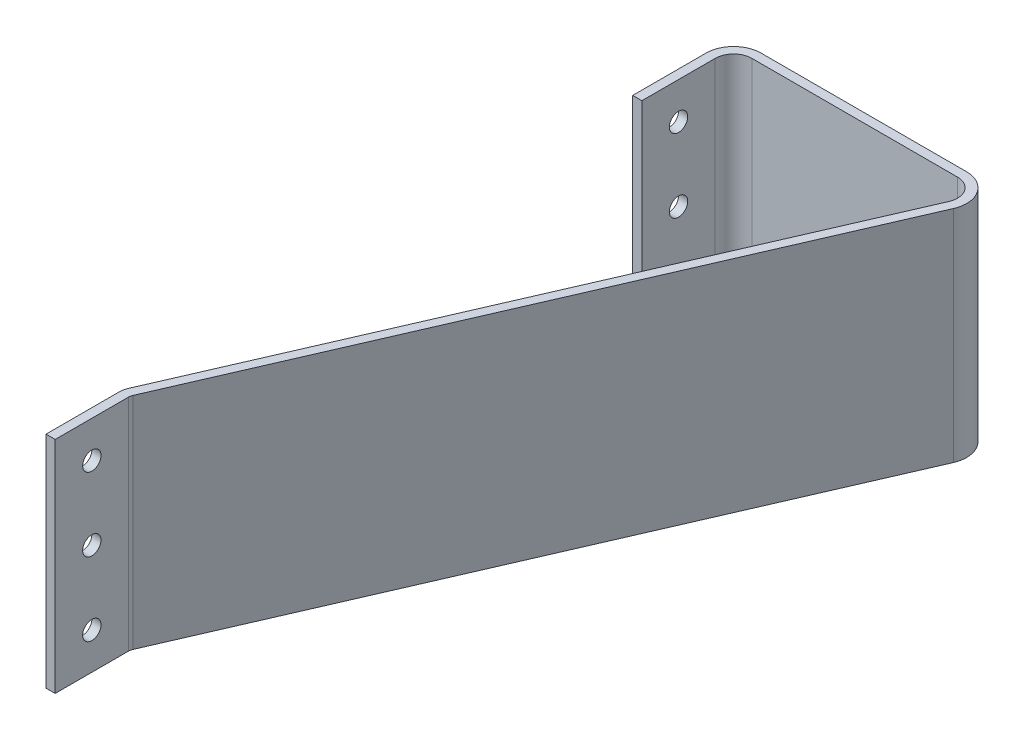
ISO-10303-21;
HEADER;
FILE_DESCRIPTION(('STEP AP214'),'2;1');
FILE_NAME('part.step','',(''),(''),'','','');
FILE_SCHEMA(('AUTOMOTIVE_DESIGN { 1 0 10303 214 1 1 1 1 }'));
ENDSEC;
DATA;
#1=APPLICATION_CONTEXT('core data for automotive mechanical design processes');
#2=APPLICATION_PROTOCOL_DEFINITION('international standard','automotive_design',2000,#1);
#3=PRODUCT_CONTEXT('',#1,'mechanical');
#4=PRODUCT('Part','Part','',(#3));
#5=PRODUCT_RELATED_PRODUCT_CATEGORY('part','',(#4));
#6=PRODUCT_DEFINITION_FORMATION('','',#4);
#7=PRODUCT_DEFINITION_CONTEXT('part definition',#1,'design');
#8=PRODUCT_DEFINITION('design','',#6,#7);
#9=PRODUCT_DEFINITION_SHAPE('','',#8);
#10=(LENGTH_UNIT() NAMED_UNIT(*) SI_UNIT(.MILLI.,.METRE.));
#11=(NAMED_UNIT(*) PLANE_ANGLE_UNIT() SI_UNIT($,.RADIAN.));
#12=(NAMED_UNIT(*) SI_UNIT($,.STERADIAN.) SOLID_ANGLE_UNIT());
#13=UNCERTAINTY_MEASURE_WITH_UNIT(LENGTH_MEASURE(1.E-05),#10,'distance_accuracy_value','');
#14=(GEOMETRIC_REPRESENTATION_CONTEXT(3) GLOBAL_UNCERTAINTY_ASSIGNED_CONTEXT((#13)) GLOBAL_UNIT_ASSIGNED_CONTEXT((#10,
#11,#12)) REPRESENTATION_CONTEXT('',''));
#15=CARTESIAN_POINT('',(0.,0.,0.));
#16=DIRECTION('',(0.,0.,1.));
#17=DIRECTION('',(1.,0.,0.));
#18=AXIS2_PLACEMENT_3D('',#15,#16,#17);
#19=CARTESIAN_POINT('',(-279.4,76.2,0.));
#20=DIRECTION('',(0.,0.,-1.));
#21=DIRECTION('',(-1.,0.,0.));
#22=AXIS2_PLACEMENT_3D('',#19,#20,#21);
#23=PLANE('',#22);
#24=DIRECTION('',(1.,0.,0.));
#25=VECTOR('',#24,1.);
#26=CARTESIAN_POINT('',(-279.4,0.,0.));
#27=LINE('',#26,#25);
#28=CARTESIAN_POINT('',(-279.4,0.,0.));
#29=VERTEX_POINT('',#28);
#30=CARTESIAN_POINT('',(-276.225,0.,0.));
#31=VERTEX_POINT('',#30);
#32=EDGE_CURVE('E192',#29,#31,#27,.T.);
#33=ORIENTED_EDGE('',*,*,#32,.T.);
#34=DIRECTION('',(0.,-1.,0.));
#35=VECTOR('',#34,1.);
#36=CARTESIAN_POINT('',(-276.225,76.2,0.));
#37=LINE('',#36,#35);
#38=CARTESIAN_POINT('',(-276.225,76.2,0.));
#39=VERTEX_POINT('',#38);
#40=EDGE_CURVE('E11',#39,#31,#37,.T.);
#41=ORIENTED_EDGE('',*,*,#40,.F.);
#42=DIRECTION('',(1.,0.,0.));
#43=VECTOR('',#42,1.);
#44=CARTESIAN_POINT('',(-279.4,76.2,0.));
#45=LINE('',#44,#43);
#46=CARTESIAN_POINT('',(-279.4,76.2,0.));
#47=VERTEX_POINT('',#46);
#48=EDGE_CURVE('E239',#47,#39,#45,.T.);
#49=ORIENTED_EDGE('',*,*,#48,.F.);
#50=DIRECTION('',(0.,-1.,0.));
#51=VECTOR('',#50,1.);
#52=CARTESIAN_POINT('',(-279.4,76.2,0.));
#53=LINE('',#52,#51);
#54=EDGE_CURVE('E188',#47,#29,#53,.T.);
#55=ORIENTED_EDGE('',*,*,#54,.T.);
#56=EDGE_LOOP('',(#33,#41,#49,#55));
#57=FACE_BOUND('',#56,.T.);
#58=ADVANCED_FACE('F43',(#57),#23,.F.);
#59=CARTESIAN_POINT('',(-276.225,76.2,0.));
#60=DIRECTION('',(-1.,0.,0.));
#61=DIRECTION('',(0.,0.,1.));
#62=AXIS2_PLACEMENT_3D('',#59,#60,#61);
#63=PLANE('',#62);
#64=CARTESIAN_POINT('',(-276.225,63.5,-12.7));
#65=DIRECTION('',(-1.,0.,0.));
#66=DIRECTION('',(0.,0.,1.));
#67=AXIS2_PLACEMENT_3D('',#64,#65,#66);
#68=CIRCLE('',#67,3.175);
#69=CARTESIAN_POINT('',(-276.225,63.5,-9.525));
#70=VERTEX_POINT('',#69);
#71=EDGE_CURVE('E197',#70,#70,#68,.T.);
#72=ORIENTED_EDGE('',*,*,#71,.T.);
#73=EDGE_LOOP('',(#72));
#74=FACE_BOUND('',#73,.T.);
#75=CARTESIAN_POINT('',(-276.225,38.1,-12.7));
#76=DIRECTION('',(-1.,0.,0.));
#77=DIRECTION('',(0.,0.,1.));
#78=AXIS2_PLACEMENT_3D('',#75,#76,#77);
#79=CIRCLE('',#78,3.175);
#80=CARTESIAN_POINT('',(-276.225,38.1,-9.525));
#81=VERTEX_POINT('',#80);
#82=EDGE_CURVE('E661',#81,#81,#79,.T.);
#83=ORIENTED_EDGE('',*,*,#82,.T.);
#84=EDGE_LOOP('',(#83));
#85=FACE_BOUND('',#84,.T.);
#86=CARTESIAN_POINT('',(-276.225,12.7,-12.7));
#87=DIRECTION('',(-1.,0.,0.));
#88=DIRECTION('',(0.,0.,1.));
#89=AXIS2_PLACEMENT_3D('',#86,#87,#88);
#90=CIRCLE('',#89,3.175);
#91=CARTESIAN_POINT('',(-276.225,12.7,-9.52500000000001));
#92=VERTEX_POINT('',#91);
#93=EDGE_CURVE('E650',#92,#92,#90,.T.);
#94=ORIENTED_EDGE('',*,*,#93,.T.);
#95=EDGE_LOOP('',(#94));
#96=FACE_BOUND('',#95,.T.);
#97=DIRECTION('',(0.,0.,-1.));
#98=VECTOR('',#97,1.);
#99=CARTESIAN_POINT('',(-276.225,0.,0.));
#100=LINE('',#99,#98);
#101=CARTESIAN_POINT('',(-276.225,0.,-25.4));
#102=VERTEX_POINT('',#101);
#103=EDGE_CURVE('E196',#31,#102,#100,.T.);
#104=ORIENTED_EDGE('',*,*,#103,.T.);
#105=DIRECTION('',(0.,-1.,0.));
#106=VECTOR('',#105,1.);
#107=CARTESIAN_POINT('',(-276.225,76.2,-25.4));
#108=LINE('',#107,#106);
#109=CARTESIAN_POINT('',(-276.225,76.2,-25.4));
#110=VERTEX_POINT('',#109);
#111=EDGE_CURVE('E52',#110,#102,#108,.T.);
#112=ORIENTED_EDGE('',*,*,#111,.F.);
#113=DIRECTION('',(0.,0.,-1.));
#114=VECTOR('',#113,1.);
#115=CARTESIAN_POINT('',(-276.225,76.2,0.));
#116=LINE('',#115,#114);
#117=EDGE_CURVE('E127',#39,#110,#116,.T.);
#118=ORIENTED_EDGE('',*,*,#117,.F.);
#119=ORIENTED_EDGE('',*,*,#40,.T.);
#120=EDGE_LOOP('',(#104,#112,#118,#119));
#121=FACE_BOUND('',#120,.T.);
#122=ADVANCED_FACE('F364',(#74,#85,#96,#121),#63,.F.);
#123=CARTESIAN_POINT('',(-273.05,76.2,-25.4));
#124=DIRECTION('',(0.,-1.,0.));
#125=DIRECTION('',(0.,0.,-1.));
#126=AXIS2_PLACEMENT_3D('',#123,#124,#125);
#127=CYLINDRICAL_SURFACE('',#126,3.17499999999998);
#128=CARTESIAN_POINT('',(-273.05,0.,-25.4));
#129=DIRECTION('',(0.,-1.,0.));
#130=DIRECTION('',(0.,0.,-1.));
#131=AXIS2_PLACEMENT_3D('',#128,#129,#130);
#132=CIRCLE('',#131,3.17499999999998);
#133=CARTESIAN_POINT('',(-275.962336725383,0.,-26.6644840046377));
#134=VERTEX_POINT('',#133);
#135=EDGE_CURVE('E200',#102,#134,#132,.T.);
#136=ORIENTED_EDGE('',*,*,#135,.T.);
#137=DIRECTION('',(0.,-1.,0.));
#138=VECTOR('',#137,1.);
#139=CARTESIAN_POINT('',(-275.962336725383,76.2,-26.6644840046377));
#140=LINE('',#139,#138);
#141=CARTESIAN_POINT('',(-275.962336725383,76.2,-26.6644840046377));
#142=VERTEX_POINT('',#141);
#143=EDGE_CURVE('E282',#142,#134,#140,.T.);
#144=ORIENTED_EDGE('',*,*,#143,.F.);
#145=CARTESIAN_POINT('',(-273.05,76.2,-25.4));
#146=DIRECTION('',(0.,-1.,0.));
#147=DIRECTION('',(0.,0.,-1.));
#148=AXIS2_PLACEMENT_3D('',#145,#146,#147);
#149=CIRCLE('',#148,3.17499999999998);
#150=EDGE_CURVE('E292',#110,#142,#149,.T.);
#151=ORIENTED_EDGE('',*,*,#150,.F.);
#152=ORIENTED_EDGE('',*,*,#111,.T.);
#153=EDGE_LOOP('',(#136,#144,#151,#152));
#154=FACE_BOUND('',#153,.T.);
#155=ADVANCED_FACE('F290',(#154),#127,.F.);
#156=CARTESIAN_POINT('',(-275.962336725383,76.2,-26.6644840046377));
#157=DIRECTION('',(-0.91727140956949,0.,-0.398262678626055));
#158=DIRECTION('',(-0.398262678626055,0.,0.91727140956949));
#159=AXIS2_PLACEMENT_3D('',#156,#157,#158);
#160=PLANE('',#159);
#161=DIRECTION('',(0.398262678626055,0.,-0.91727140956949));
#162=VECTOR('',#161,1.);
#163=CARTESIAN_POINT('',(-275.962336725383,0.,-26.6644840046377));
#164=LINE('',#163,#162);
#165=CARTESIAN_POINT('',(-189.932631311602,0.,-224.806547986087));
#166=VERTEX_POINT('',#165);
#167=EDGE_CURVE('E203',#134,#166,#164,.T.);
#168=ORIENTED_EDGE('',*,*,#167,.T.);
#169=DIRECTION('',(0.,-1.,0.));
#170=VECTOR('',#169,1.);
#171=CARTESIAN_POINT('',(-189.932631311602,76.2,-224.806547986087));
#172=LINE('',#171,#170);
#173=CARTESIAN_POINT('',(-189.932631311602,76.2,-224.806547986087));
#174=VERTEX_POINT('',#173);
#175=EDGE_CURVE('E278',#174,#166,#172,.T.);
#176=ORIENTED_EDGE('',*,*,#175,.F.);
#177=DIRECTION('',(0.398262678626055,0.,-0.91727140956949));
#178=VECTOR('',#177,1.);
#179=CARTESIAN_POINT('',(-275.962336725383,76.2,-26.6644840046377));
#180=LINE('',#179,#178);
#181=EDGE_CURVE('E311',#142,#174,#180,.T.);
#182=ORIENTED_EDGE('',*,*,#181,.F.);
#183=ORIENTED_EDGE('',*,*,#143,.T.);
#184=EDGE_LOOP('',(#168,#176,#182,#183));
#185=FACE_BOUND('',#184,.T.);
#186=ADVANCED_FACE('F301',(#185),#160,.F.);
#187=CARTESIAN_POINT('',(-198.669641487751,76.2,-228.6));
#188=DIRECTION('',(0.,-1.,0.));
#189=DIRECTION('',(0.,0.,-1.));
#190=AXIS2_PLACEMENT_3D('',#187,#188,#189);
#191=CYLINDRICAL_SURFACE('',#190,9.52499999999998);
#192=CARTESIAN_POINT('',(-198.669641487751,0.,-228.6));
#193=DIRECTION('',(0.,1.,0.));
#194=DIRECTION('',(0.,0.,1.));
#195=AXIS2_PLACEMENT_3D('',#192,#193,#194);
#196=CIRCLE('',#195,9.52499999999998);
#197=CARTESIAN_POINT('',(-198.669641487751,0.,-238.125));
#198=VERTEX_POINT('',#197);
#199=EDGE_CURVE('E206',#166,#198,#196,.T.);
#200=ORIENTED_EDGE('',*,*,#199,.T.);
#201=DIRECTION('',(0.,-1.,0.));
#202=VECTOR('',#201,1.);
#203=CARTESIAN_POINT('',(-198.669641487751,76.2,-238.125));
#204=LINE('',#203,#202);
#205=CARTESIAN_POINT('',(-198.669641487751,76.2,-238.125));
#206=VERTEX_POINT('',#205);
#207=EDGE_CURVE('E274',#206,#198,#204,.T.);
#208=ORIENTED_EDGE('',*,*,#207,.F.);
#209=CARTESIAN_POINT('',(-198.669641487751,76.2,-228.6));
#210=DIRECTION('',(0.,1.,0.));
#211=DIRECTION('',(0.,0.,1.));
#212=AXIS2_PLACEMENT_3D('',#209,#210,#211);
#213=CIRCLE('',#212,9.52499999999998);
#214=EDGE_CURVE('E307',#174,#206,#213,.T.);
#215=ORIENTED_EDGE('',*,*,#214,.F.);
#216=ORIENTED_EDGE('',*,*,#175,.T.);
#217=EDGE_LOOP('',(#200,#208,#215,#216));
#218=FACE_BOUND('',#217,.T.);
#219=ADVANCED_FACE('F305',(#218),#191,.T.);
#220=CARTESIAN_POINT('',(-269.875,76.2,-238.125));
#221=DIRECTION('',(0.,0.,1.));
#222=DIRECTION('',(1.,0.,0.));
#223=AXIS2_PLACEMENT_3D('',#220,#221,#222);
#224=PLANE('',#223);
#225=DIRECTION('',(-1.,0.,0.));
#226=VECTOR('',#225,1.);
#227=CARTESIAN_POINT('',(-269.875,0.,-238.125));
#228=LINE('',#227,#226);
#229=CARTESIAN_POINT('',(-269.875,0.,-238.125));
#230=VERTEX_POINT('',#229);
#231=EDGE_CURVE('E209',#198,#230,#228,.T.);
#232=ORIENTED_EDGE('',*,*,#231,.T.);
#233=DIRECTION('',(0.,-1.,0.));
#234=VECTOR('',#233,1.);
#235=CARTESIAN_POINT('',(-269.875,76.2,-238.125));
#236=LINE('',#235,#234);
#237=CARTESIAN_POINT('',(-269.875,76.2,-238.125));
#238=VERTEX_POINT('',#237);
#239=EDGE_CURVE('E270',#238,#230,#236,.T.);
#240=ORIENTED_EDGE('',*,*,#239,.F.);
#241=DIRECTION('',(-1.,0.,0.));
#242=VECTOR('',#241,1.);
#243=CARTESIAN_POINT('',(-269.875,76.2,-238.125));
#244=LINE('',#243,#242);
#245=EDGE_CURVE('E310',#206,#238,#244,.T.);
#246=ORIENTED_EDGE('',*,*,#245,.F.);
#247=ORIENTED_EDGE('',*,*,#207,.T.);
#248=EDGE_LOOP('',(#232,#240,#246,#247));
#249=FACE_BOUND('',#248,.T.);
#250=ADVANCED_FACE('F380',(#249),#224,.F.);
#251=CARTESIAN_POINT('',(-269.875,76.2,-228.6));
#252=DIRECTION('',(0.,-1.,0.));
#253=DIRECTION('',(0.,0.,-1.));
#254=AXIS2_PLACEMENT_3D('',#251,#252,#253);
#255=CYLINDRICAL_SURFACE('',#254,9.52500000000001);
#256=CARTESIAN_POINT('',(-269.875,0.,-228.6));
#257=DIRECTION('',(0.,1.,0.));
#258=DIRECTION('',(0.,0.,-1.));
#259=AXIS2_PLACEMENT_3D('',#256,#257,#258);
#260=CIRCLE('',#259,9.52500000000001);
#261=CARTESIAN_POINT('',(-279.4,0.,-228.6));
#262=VERTEX_POINT('',#261);
#263=EDGE_CURVE('E212',#230,#262,#260,.T.);
#264=ORIENTED_EDGE('',*,*,#263,.T.);
#265=DIRECTION('',(0.,-1.,0.));
#266=VECTOR('',#265,1.);
#267=CARTESIAN_POINT('',(-279.4,76.2,-228.6));
#268=LINE('',#267,#266);
#269=CARTESIAN_POINT('',(-279.4,76.2,-228.6));
#270=VERTEX_POINT('',#269);
#271=EDGE_CURVE('E266',#270,#262,#268,.T.);
#272=ORIENTED_EDGE('',*,*,#271,.F.);
#273=CARTESIAN_POINT('',(-269.875,76.2,-228.6));
#274=DIRECTION('',(0.,1.,0.));
#275=DIRECTION('',(0.,0.,-1.));
#276=AXIS2_PLACEMENT_3D('',#273,#274,#275);
#277=CIRCLE('',#276,9.52500000000001);
#278=EDGE_CURVE('E315',#238,#270,#277,.T.);
#279=ORIENTED_EDGE('',*,*,#278,.F.);
#280=ORIENTED_EDGE('',*,*,#239,.T.);
#281=EDGE_LOOP('',(#264,#272,#279,#280));
#282=FACE_BOUND('',#281,.T.);
#283=ADVANCED_FACE('F383',(#282),#255,.T.);
#284=CARTESIAN_POINT('',(-279.4,76.2,-228.6));
#285=DIRECTION('',(1.,0.,0.));
#286=DIRECTION('',(0.,0.,-1.));
#287=AXIS2_PLACEMENT_3D('',#284,#285,#286);
#288=PLANE('',#287);
#289=CARTESIAN_POINT('',(-279.4,12.7,-215.9));
#290=DIRECTION('',(-1.,0.,0.));
#291=DIRECTION('',(0.,0.,1.));
#292=AXIS2_PLACEMENT_3D('',#289,#290,#291);
#293=CIRCLE('',#292,3.17499999999997);
#294=CARTESIAN_POINT('',(-279.4,12.7,-212.725));
#295=VERTEX_POINT('',#294);
#296=EDGE_CURVE('E626',#295,#295,#293,.T.);
#297=ORIENTED_EDGE('',*,*,#296,.F.);
#298=EDGE_LOOP('',(#297));
#299=FACE_BOUND('',#298,.T.);
#300=CARTESIAN_POINT('',(-279.4,63.5,-215.9));
#301=DIRECTION('',(-1.,0.,0.));
#302=DIRECTION('',(0.,0.,1.));
#303=AXIS2_PLACEMENT_3D('',#300,#301,#302);
#304=CIRCLE('',#303,3.17499999999997);
#305=CARTESIAN_POINT('',(-279.4,63.5,-212.725));
#306=VERTEX_POINT('',#305);
#307=EDGE_CURVE('E633',#306,#306,#304,.T.);
#308=ORIENTED_EDGE('',*,*,#307,.F.);
#309=EDGE_LOOP('',(#308));
#310=FACE_BOUND('',#309,.T.);
#311=CARTESIAN_POINT('',(-279.4,38.1,-215.9));
#312=DIRECTION('',(-1.,0.,0.));
#313=DIRECTION('',(0.,0.,1.));
#314=AXIS2_PLACEMENT_3D('',#311,#312,#313);
#315=CIRCLE('',#314,3.17499999999997);
#316=CARTESIAN_POINT('',(-279.4,38.1,-212.725));
#317=VERTEX_POINT('',#316);
#318=EDGE_CURVE('E638',#317,#317,#315,.T.);
#319=ORIENTED_EDGE('',*,*,#318,.F.);
#320=EDGE_LOOP('',(#319));
#321=FACE_BOUND('',#320,.T.);
#322=DIRECTION('',(0.,0.,1.));
#323=VECTOR('',#322,1.);
#324=CARTESIAN_POINT('',(-279.4,0.,-228.6));
#325=LINE('',#324,#323);
#326=CARTESIAN_POINT('',(-279.4,0.,-203.2));
#327=VERTEX_POINT('',#326);
#328=EDGE_CURVE('E215',#262,#327,#325,.T.);
#329=ORIENTED_EDGE('',*,*,#328,.T.);
#330=DIRECTION('',(0.,-1.,0.));
#331=VECTOR('',#330,1.);
#332=CARTESIAN_POINT('',(-279.4,76.2,-203.2));
#333=LINE('',#332,#331);
#334=CARTESIAN_POINT('',(-279.4,76.2,-203.2));
#335=VERTEX_POINT('',#334);
#336=EDGE_CURVE('E262',#335,#327,#333,.T.);
#337=ORIENTED_EDGE('',*,*,#336,.F.);
#338=DIRECTION('',(0.,0.,1.));
#339=VECTOR('',#338,1.);
#340=CARTESIAN_POINT('',(-279.4,76.2,-228.6));
#341=LINE('',#340,#339);
#342=EDGE_CURVE('E322',#270,#335,#341,.T.);
#343=ORIENTED_EDGE('',*,*,#342,.F.);
#344=ORIENTED_EDGE('',*,*,#271,.T.);
#345=EDGE_LOOP('',(#329,#337,#343,#344));
#346=FACE_BOUND('',#345,.T.);
#347=ADVANCED_FACE('F387',(#299,#310,#321,#346),#288,.F.);
#348=CARTESIAN_POINT('',(-279.4,76.2,-203.2));
#349=DIRECTION('',(0.,0.,-1.));
#350=DIRECTION('',(-1.,0.,0.));
#351=AXIS2_PLACEMENT_3D('',#348,#349,#350);
#352=PLANE('',#351);
#353=DIRECTION('',(1.,0.,0.));
#354=VECTOR('',#353,1.);
#355=CARTESIAN_POINT('',(-279.4,0.,-203.2));
#356=LINE('',#355,#354);
#357=CARTESIAN_POINT('',(-276.225,0.,-203.2));
#358=VERTEX_POINT('',#357);
#359=EDGE_CURVE('E218',#327,#358,#356,.T.);
#360=ORIENTED_EDGE('',*,*,#359,.T.);
#361=DIRECTION('',(0.,-1.,0.));
#362=VECTOR('',#361,1.);
#363=CARTESIAN_POINT('',(-276.225,76.2,-203.2));
#364=LINE('',#363,#362);
#365=CARTESIAN_POINT('',(-276.225,76.2,-203.2));
#366=VERTEX_POINT('',#365);
#367=EDGE_CURVE('E258',#366,#358,#364,.T.);
#368=ORIENTED_EDGE('',*,*,#367,.F.);
#369=DIRECTION('',(1.,0.,0.));
#370=VECTOR('',#369,1.);
#371=CARTESIAN_POINT('',(-279.4,76.2,-203.2));
#372=LINE('',#371,#370);
#373=EDGE_CURVE('E325',#335,#366,#372,.T.);
#374=ORIENTED_EDGE('',*,*,#373,.F.);
#375=ORIENTED_EDGE('',*,*,#336,.T.);
#376=EDGE_LOOP('',(#360,#368,#374,#375));
#377=FACE_BOUND('',#376,.T.);
#378=ADVANCED_FACE('F391',(#377),#352,.F.);
#379=CARTESIAN_POINT('',(-276.225,76.2,-228.6));
#380=DIRECTION('',(-1.,0.,0.));
#381=DIRECTION('',(0.,0.,1.));
#382=AXIS2_PLACEMENT_3D('',#379,#380,#381);
#383=PLANE('',#382);
#384=CARTESIAN_POINT('',(-276.225,12.7,-215.9));
#385=DIRECTION('',(-1.,0.,0.));
#386=DIRECTION('',(0.,0.,1.));
#387=AXIS2_PLACEMENT_3D('',#384,#385,#386);
#388=CIRCLE('',#387,3.17499999999997);
#389=CARTESIAN_POINT('',(-276.225,12.7,-212.725));
#390=VERTEX_POINT('',#389);
#391=EDGE_CURVE('E623',#390,#390,#388,.F.);
#392=ORIENTED_EDGE('',*,*,#391,.F.);
#393=EDGE_LOOP('',(#392));
#394=FACE_BOUND('',#393,.T.);
#395=CARTESIAN_POINT('',(-276.225,63.5,-215.9));
#396=DIRECTION('',(-1.,0.,0.));
#397=DIRECTION('',(0.,0.,1.));
#398=AXIS2_PLACEMENT_3D('',#395,#396,#397);
#399=CIRCLE('',#398,3.17499999999997);
#400=CARTESIAN_POINT('',(-276.225,63.5,-212.725));
#401=VERTEX_POINT('',#400);
#402=EDGE_CURVE('E628',#401,#401,#399,.F.);
#403=ORIENTED_EDGE('',*,*,#402,.F.);
#404=EDGE_LOOP('',(#403));
#405=FACE_BOUND('',#404,.T.);
#406=CARTESIAN_POINT('',(-276.225,38.1,-215.9));
#407=DIRECTION('',(-1.,0.,0.));
#408=DIRECTION('',(0.,0.,1.));
#409=AXIS2_PLACEMENT_3D('',#406,#407,#408);
#410=CIRCLE('',#409,3.17499999999997);
#411=CARTESIAN_POINT('',(-276.225,38.1,-212.725));
#412=VERTEX_POINT('',#411);
#413=EDGE_CURVE('E642',#412,#412,#410,.F.);
#414=ORIENTED_EDGE('',*,*,#413,.F.);
#415=EDGE_LOOP('',(#414));
#416=FACE_BOUND('',#415,.T.);
#417=DIRECTION('',(0.,0.,-1.));
#418=VECTOR('',#417,1.);
#419=CARTESIAN_POINT('',(-276.225,0.,-228.6));
#420=LINE('',#419,#418);
#421=CARTESIAN_POINT('',(-276.225,0.,-228.6));
#422=VERTEX_POINT('',#421);
#423=EDGE_CURVE('E221',#358,#422,#420,.T.);
#424=ORIENTED_EDGE('',*,*,#423,.T.);
#425=DIRECTION('',(0.,-1.,0.));
#426=VECTOR('',#425,1.);
#427=CARTESIAN_POINT('',(-276.225,76.2,-228.6));
#428=LINE('',#427,#426);
#429=CARTESIAN_POINT('',(-276.225,76.2,-228.6));
#430=VERTEX_POINT('',#429);
#431=EDGE_CURVE('E254',#430,#422,#428,.T.);
#432=ORIENTED_EDGE('',*,*,#431,.F.);
#433=DIRECTION('',(0.,0.,-1.));
#434=VECTOR('',#433,1.);
#435=CARTESIAN_POINT('',(-276.225,76.2,-228.6));
#436=LINE('',#435,#434);
#437=EDGE_CURVE('E328',#366,#430,#436,.T.);
#438=ORIENTED_EDGE('',*,*,#437,.F.);
#439=ORIENTED_EDGE('',*,*,#367,.T.);
#440=EDGE_LOOP('',(#424,#432,#438,#439));
#441=FACE_BOUND('',#440,.T.);
#442=ADVANCED_FACE('F395',(#394,#405,#416,#441),#383,.F.);
#443=CARTESIAN_POINT('',(-269.875,76.2,-228.6));
#444=DIRECTION('',(0.,-1.,0.));
#445=DIRECTION('',(0.,0.,-1.));
#446=AXIS2_PLACEMENT_3D('',#443,#444,#445);
#447=CYLINDRICAL_SURFACE('',#446,6.35000000000004);
#448=CARTESIAN_POINT('',(-269.875,0.,-228.6));
#449=DIRECTION('',(0.,-1.,0.));
#450=DIRECTION('',(0.,0.,-1.));
#451=AXIS2_PLACEMENT_3D('',#448,#449,#450);
#452=CIRCLE('',#451,6.35000000000004);
#453=CARTESIAN_POINT('',(-269.875,0.,-234.95));
#454=VERTEX_POINT('',#453);
#455=EDGE_CURVE('E224',#422,#454,#452,.T.);
#456=ORIENTED_EDGE('',*,*,#455,.T.);
#457=DIRECTION('',(0.,-1.,0.));
#458=VECTOR('',#457,1.);
#459=CARTESIAN_POINT('',(-269.875,76.2,-234.95));
#460=LINE('',#459,#458);
#461=CARTESIAN_POINT('',(-269.875,76.2,-234.95));
#462=VERTEX_POINT('',#461);
#463=EDGE_CURVE('E250',#462,#454,#460,.T.);
#464=ORIENTED_EDGE('',*,*,#463,.F.);
#465=CARTESIAN_POINT('',(-269.875,76.2,-228.6));
#466=DIRECTION('',(0.,-1.,0.));
#467=DIRECTION('',(0.,0.,-1.));
#468=AXIS2_PLACEMENT_3D('',#465,#466,#467);
#469=CIRCLE('',#468,6.35000000000004);
#470=EDGE_CURVE('E331',#430,#462,#469,.T.);
#471=ORIENTED_EDGE('',*,*,#470,.F.);
#472=ORIENTED_EDGE('',*,*,#431,.T.);
#473=EDGE_LOOP('',(#456,#464,#471,#472));
#474=FACE_BOUND('',#473,.T.);
#475=ADVANCED_FACE('F399',(#474),#447,.F.);
#476=CARTESIAN_POINT('',(-198.669641487751,76.2,-234.95));
#477=DIRECTION('',(0.,0.,-1.));
#478=DIRECTION('',(-1.,0.,0.));
#479=AXIS2_PLACEMENT_3D('',#476,#477,#478);
#480=PLANE('',#479);
#481=DIRECTION('',(1.,0.,0.));
#482=VECTOR('',#481,1.);
#483=CARTESIAN_POINT('',(-198.669641487751,0.,-234.95));
#484=LINE('',#483,#482);
#485=CARTESIAN_POINT('',(-198.669641487751,0.,-234.95));
#486=VERTEX_POINT('',#485);
#487=EDGE_CURVE('E227',#454,#486,#484,.T.);
#488=ORIENTED_EDGE('',*,*,#487,.T.);
#489=DIRECTION('',(0.,-1.,0.));
#490=VECTOR('',#489,1.);
#491=CARTESIAN_POINT('',(-198.669641487751,76.2,-234.95));
#492=LINE('',#491,#490);
#493=CARTESIAN_POINT('',(-198.669641487751,76.2,-234.95));
#494=VERTEX_POINT('',#493);
#495=EDGE_CURVE('E246',#494,#486,#492,.T.);
#496=ORIENTED_EDGE('',*,*,#495,.F.);
#497=DIRECTION('',(1.,0.,0.));
#498=VECTOR('',#497,1.);
#499=CARTESIAN_POINT('',(-198.669641487751,76.2,-234.95));
#500=LINE('',#499,#498);
#501=EDGE_CURVE('E334',#462,#494,#500,.T.);
#502=ORIENTED_EDGE('',*,*,#501,.F.);
#503=ORIENTED_EDGE('',*,*,#463,.T.);
#504=EDGE_LOOP('',(#488,#496,#502,#503));
#505=FACE_BOUND('',#504,.T.);
#506=ADVANCED_FACE('F342',(#505),#480,.F.);
#507=CARTESIAN_POINT('',(-198.669641487751,76.2,-228.6));
#508=DIRECTION('',(0.,-1.,0.));
#509=DIRECTION('',(0.,0.,-1.));
#510=AXIS2_PLACEMENT_3D('',#507,#508,#509);
#511=CYLINDRICAL_SURFACE('',#510,6.35);
#512=CARTESIAN_POINT('',(-198.669641487751,0.,-228.6));
#513=DIRECTION('',(0.,-1.,0.));
#514=DIRECTION('',(0.,0.,1.));
#515=AXIS2_PLACEMENT_3D('',#512,#513,#514);
#516=CIRCLE('',#515,6.35);
#517=CARTESIAN_POINT('',(-192.844968036985,0.,-226.071031990725));
#518=VERTEX_POINT('',#517);
#519=EDGE_CURVE('E230',#486,#518,#516,.T.);
#520=ORIENTED_EDGE('',*,*,#519,.T.);
#521=DIRECTION('',(0.,-1.,0.));
#522=VECTOR('',#521,1.);
#523=CARTESIAN_POINT('',(-192.844968036985,76.2,-226.071031990725));
#524=LINE('',#523,#522);
#525=CARTESIAN_POINT('',(-192.844968036985,76.2,-226.071031990725));
#526=VERTEX_POINT('',#525);
#527=EDGE_CURVE('E181',#526,#518,#524,.T.);
#528=ORIENTED_EDGE('',*,*,#527,.F.);
#529=CARTESIAN_POINT('',(-198.669641487751,76.2,-228.6));
#530=DIRECTION('',(0.,-1.,0.));
#531=DIRECTION('',(0.,0.,1.));
#532=AXIS2_PLACEMENT_3D('',#529,#530,#531);
#533=CIRCLE('',#532,6.35);
#534=EDGE_CURVE('E170',#494,#526,#533,.T.);
#535=ORIENTED_EDGE('',*,*,#534,.F.);
#536=ORIENTED_EDGE('',*,*,#495,.T.);
#537=EDGE_LOOP('',(#520,#528,#535,#536));
#538=FACE_BOUND('',#537,.T.);
#539=ADVANCED_FACE('F346',(#538),#511,.F.);
#540=CARTESIAN_POINT('',(-278.874673450766,76.2,-27.9289680092755));
#541=DIRECTION('',(0.91727140956949,0.,0.398262678626056));
#542=DIRECTION('',(0.398262678626056,0.,-0.91727140956949));
#543=AXIS2_PLACEMENT_3D('',#540,#541,#542);
#544=PLANE('',#543);
#545=DIRECTION('',(-0.398262678626056,0.,0.91727140956949));
#546=VECTOR('',#545,1.);
#547=CARTESIAN_POINT('',(-278.874673450766,0.,-27.9289680092755));
#548=LINE('',#547,#546);
#549=CARTESIAN_POINT('',(-278.874673450766,0.,-27.9289680092755));
#550=VERTEX_POINT('',#549);
#551=EDGE_CURVE('E179',#518,#550,#548,.T.);
#552=ORIENTED_EDGE('',*,*,#551,.T.);
#553=DIRECTION('',(0.,-1.,0.));
#554=VECTOR('',#553,1.);
#555=CARTESIAN_POINT('',(-278.874673450766,76.2,-27.9289680092755));
#556=LINE('',#555,#554);
#557=CARTESIAN_POINT('',(-278.874673450766,76.2,-27.9289680092755));
#558=VERTEX_POINT('',#557);
#559=EDGE_CURVE('E176',#558,#550,#556,.T.);
#560=ORIENTED_EDGE('',*,*,#559,.F.);
#561=DIRECTION('',(-0.398262678626056,0.,0.91727140956949));
#562=VECTOR('',#561,1.);
#563=CARTESIAN_POINT('',(-278.874673450766,76.2,-27.9289680092755));
#564=LINE('',#563,#562);
#565=EDGE_CURVE('E164',#526,#558,#564,.T.);
#566=ORIENTED_EDGE('',*,*,#565,.F.);
#567=ORIENTED_EDGE('',*,*,#527,.T.);
#568=EDGE_LOOP('',(#552,#560,#566,#567));
#569=FACE_BOUND('',#568,.T.);
#570=ADVANCED_FACE('F177',(#569),#544,.F.);
#571=CARTESIAN_POINT('',(-273.05,76.2,-25.4));
#572=DIRECTION('',(0.,-1.,0.));
#573=DIRECTION('',(0.,0.,-1.));
#574=AXIS2_PLACEMENT_3D('',#571,#572,#573);
#575=CYLINDRICAL_SURFACE('',#574,6.35000000000001);
#576=CARTESIAN_POINT('',(-273.05,0.,-25.4));
#577=DIRECTION('',(0.,1.,0.));
#578=DIRECTION('',(0.,0.,-1.));
#579=AXIS2_PLACEMENT_3D('',#576,#577,#578);
#580=CIRCLE('',#579,6.35000000000001);
#581=CARTESIAN_POINT('',(-279.4,0.,-25.4));
#582=VERTEX_POINT('',#581);
#583=EDGE_CURVE('E113',#550,#582,#580,.T.);
#584=ORIENTED_EDGE('',*,*,#583,.T.);
#585=DIRECTION('',(0.,-1.,0.));
#586=VECTOR('',#585,1.);
#587=CARTESIAN_POINT('',(-279.4,76.2,-25.4));
#588=LINE('',#587,#586);
#589=CARTESIAN_POINT('',(-279.4,76.2,-25.4));
#590=VERTEX_POINT('',#589);
#591=EDGE_CURVE('E182',#590,#582,#588,.T.);
#592=ORIENTED_EDGE('',*,*,#591,.F.);
#593=CARTESIAN_POINT('',(-273.05,76.2,-25.4));
#594=DIRECTION('',(0.,1.,0.));
#595=DIRECTION('',(0.,0.,-1.));
#596=AXIS2_PLACEMENT_3D('',#593,#594,#595);
#597=CIRCLE('',#596,6.35000000000001);
#598=EDGE_CURVE('E168',#558,#590,#597,.T.);
#599=ORIENTED_EDGE('',*,*,#598,.F.);
#600=ORIENTED_EDGE('',*,*,#559,.T.);
#601=EDGE_LOOP('',(#584,#592,#599,#600));
#602=FACE_BOUND('',#601,.T.);
#603=ADVANCED_FACE('F184',(#602),#575,.T.);
#604=CARTESIAN_POINT('',(-279.4,76.2,0.));
#605=DIRECTION('',(1.,0.,0.));
#606=DIRECTION('',(0.,0.,-1.));
#607=AXIS2_PLACEMENT_3D('',#604,#605,#606);
#608=PLANE('',#607);
#609=CARTESIAN_POINT('',(-279.4,63.5,-12.7));
#610=DIRECTION('',(1.,0.,0.));
#611=DIRECTION('',(0.,0.,-1.));
#612=AXIS2_PLACEMENT_3D('',#609,#610,#611);
#613=CIRCLE('',#612,3.175);
#614=CARTESIAN_POINT('',(-279.4,63.5,-15.875));
#615=VERTEX_POINT('',#614);
#616=EDGE_CURVE('E647',#615,#615,#613,.T.);
#617=ORIENTED_EDGE('',*,*,#616,.T.);
#618=EDGE_LOOP('',(#617));
#619=FACE_BOUND('',#618,.T.);
#620=CARTESIAN_POINT('',(-279.4,38.1,-12.7));
#621=DIRECTION('',(1.,0.,0.));
#622=DIRECTION('',(0.,0.,-1.));
#623=AXIS2_PLACEMENT_3D('',#620,#621,#622);
#624=CIRCLE('',#623,3.175);
#625=CARTESIAN_POINT('',(-279.4,38.1,-15.875));
#626=VERTEX_POINT('',#625);
#627=EDGE_CURVE('E651',#626,#626,#624,.T.);
#628=ORIENTED_EDGE('',*,*,#627,.T.);
#629=EDGE_LOOP('',(#628));
#630=FACE_BOUND('',#629,.T.);
#631=CARTESIAN_POINT('',(-279.4,12.7,-12.7));
#632=DIRECTION('',(1.,0.,0.));
#633=DIRECTION('',(0.,0.,-1.));
#634=AXIS2_PLACEMENT_3D('',#631,#632,#633);
#635=CIRCLE('',#634,3.175);
#636=CARTESIAN_POINT('',(-279.4,12.7,-15.875));
#637=VERTEX_POINT('',#636);
#638=EDGE_CURVE('E646',#637,#637,#635,.T.);
#639=ORIENTED_EDGE('',*,*,#638,.T.);
#640=EDGE_LOOP('',(#639));
#641=FACE_BOUND('',#640,.T.);
#642=DIRECTION('',(0.,0.,1.));
#643=VECTOR('',#642,1.);
#644=CARTESIAN_POINT('',(-279.4,0.,0.));
#645=LINE('',#644,#643);
#646=EDGE_CURVE('E119',#582,#29,#645,.T.);
#647=ORIENTED_EDGE('',*,*,#646,.T.);
#648=ORIENTED_EDGE('',*,*,#54,.F.);
#649=DIRECTION('',(0.,0.,1.));
#650=VECTOR('',#649,1.);
#651=CARTESIAN_POINT('',(-279.4,76.2,0.));
#652=LINE('',#651,#650);
#653=EDGE_CURVE('E60',#590,#47,#652,.T.);
#654=ORIENTED_EDGE('',*,*,#653,.F.);
#655=ORIENTED_EDGE('',*,*,#591,.T.);
#656=EDGE_LOOP('',(#647,#648,#654,#655));
#657=FACE_BOUND('',#656,.T.);
#658=ADVANCED_FACE('F350',(#619,#630,#641,#657),#608,.F.);
#659=CARTESIAN_POINT('',(-273.05,76.2,-25.4));
#660=DIRECTION('',(0.,-1.,0.));
#661=DIRECTION('',(0.,0.,-1.));
#662=AXIS2_PLACEMENT_3D('',#659,#660,#661);
#663=PLANE('',#662);
#664=ORIENTED_EDGE('',*,*,#48,.T.);
#665=ORIENTED_EDGE('',*,*,#117,.T.);
#666=ORIENTED_EDGE('',*,*,#150,.T.);
#667=ORIENTED_EDGE('',*,*,#181,.T.);
#668=ORIENTED_EDGE('',*,*,#214,.T.);
#669=ORIENTED_EDGE('',*,*,#245,.T.);
#670=ORIENTED_EDGE('',*,*,#278,.T.);
#671=ORIENTED_EDGE('',*,*,#342,.T.);
#672=ORIENTED_EDGE('',*,*,#373,.T.);
#673=ORIENTED_EDGE('',*,*,#437,.T.);
#674=ORIENTED_EDGE('',*,*,#470,.T.);
#675=ORIENTED_EDGE('',*,*,#501,.T.);
#676=ORIENTED_EDGE('',*,*,#534,.T.);
#677=ORIENTED_EDGE('',*,*,#565,.T.);
#678=ORIENTED_EDGE('',*,*,#598,.T.);
#679=ORIENTED_EDGE('',*,*,#653,.T.);
#680=EDGE_LOOP('',(#664,#665,#666,#667,#668,#669,#670,#671,#672,#673,#674,#675,#676,#677,#678,#679));
#681=FACE_BOUND('',#680,.T.);
#682=ADVANCED_FACE('F166',(#681),#663,.F.);
#683=CARTESIAN_POINT('',(-273.05,0.,-25.4));
#684=DIRECTION('',(0.,-1.,0.));
#685=DIRECTION('',(0.,0.,-1.));
#686=AXIS2_PLACEMENT_3D('',#683,#684,#685);
#687=PLANE('',#686);
#688=ORIENTED_EDGE('',*,*,#32,.F.);
#689=ORIENTED_EDGE('',*,*,#646,.F.);
#690=ORIENTED_EDGE('',*,*,#583,.F.);
#691=ORIENTED_EDGE('',*,*,#551,.F.);
#692=ORIENTED_EDGE('',*,*,#519,.F.);
#693=ORIENTED_EDGE('',*,*,#487,.F.);
#694=ORIENTED_EDGE('',*,*,#455,.F.);
#695=ORIENTED_EDGE('',*,*,#423,.F.);
#696=ORIENTED_EDGE('',*,*,#359,.F.);
#697=ORIENTED_EDGE('',*,*,#328,.F.);
#698=ORIENTED_EDGE('',*,*,#263,.F.);
#699=ORIENTED_EDGE('',*,*,#231,.F.);
#700=ORIENTED_EDGE('',*,*,#199,.F.);
#701=ORIENTED_EDGE('',*,*,#167,.F.);
#702=ORIENTED_EDGE('',*,*,#135,.F.);
#703=ORIENTED_EDGE('',*,*,#103,.F.);
#704=EDGE_LOOP('',(#688,#689,#690,#691,#692,#693,#694,#695,#696,#697,#698,#699,#700,#701,#702,#703));
#705=FACE_BOUND('',#704,.T.);
#706=ADVANCED_FACE('F296',(#705),#687,.T.);
#707=CARTESIAN_POINT('',(-279.4,12.7,-12.7));
#708=DIRECTION('',(1.,0.,0.));
#709=DIRECTION('',(0.,0.,-1.));
#710=AXIS2_PLACEMENT_3D('',#707,#708,#709);
#711=CYLINDRICAL_SURFACE('',#710,3.175);
#712=ORIENTED_EDGE('',*,*,#638,.F.);
#713=EDGE_LOOP('',(#712));
#714=FACE_BOUND('',#713,.T.);
#715=ORIENTED_EDGE('',*,*,#93,.F.);
#716=EDGE_LOOP('',(#715));
#717=FACE_BOUND('',#716,.T.);
#718=ADVANCED_FACE('F434',(#714,#717),#711,.F.);
#719=CARTESIAN_POINT('',(-279.4,38.1,-12.7));
#720=DIRECTION('',(1.,0.,0.));
#721=DIRECTION('',(0.,0.,-1.));
#722=AXIS2_PLACEMENT_3D('',#719,#720,#721);
#723=CYLINDRICAL_SURFACE('',#722,3.175);
#724=ORIENTED_EDGE('',*,*,#627,.F.);
#725=EDGE_LOOP('',(#724));
#726=FACE_BOUND('',#725,.T.);
#727=ORIENTED_EDGE('',*,*,#82,.F.);
#728=EDGE_LOOP('',(#727));
#729=FACE_BOUND('',#728,.T.);
#730=ADVANCED_FACE('F455',(#726,#729),#723,.F.);
#731=CARTESIAN_POINT('',(-279.4,63.5,-12.7));
#732=DIRECTION('',(1.,0.,0.));
#733=DIRECTION('',(0.,0.,-1.));
#734=AXIS2_PLACEMENT_3D('',#731,#732,#733);
#735=CYLINDRICAL_SURFACE('',#734,3.175);
#736=ORIENTED_EDGE('',*,*,#616,.F.);
#737=EDGE_LOOP('',(#736));
#738=FACE_BOUND('',#737,.T.);
#739=ORIENTED_EDGE('',*,*,#71,.F.);
#740=EDGE_LOOP('',(#739));
#741=FACE_BOUND('',#740,.T.);
#742=ADVANCED_FACE('F466',(#738,#741),#735,.F.);
#743=CARTESIAN_POINT('',(-267.244743878931,38.1,-215.9));
#744=DIRECTION('',(-1.,0.,0.));
#745=DIRECTION('',(0.,0.,1.));
#746=AXIS2_PLACEMENT_3D('',#743,#744,#745);
#747=CYLINDRICAL_SURFACE('',#746,3.17499999999997);
#748=ORIENTED_EDGE('',*,*,#413,.T.);
#749=EDGE_LOOP('',(#748));
#750=FACE_BOUND('',#749,.T.);
#751=ORIENTED_EDGE('',*,*,#318,.T.);
#752=EDGE_LOOP('',(#751));
#753=FACE_BOUND('',#752,.T.);
#754=ADVANCED_FACE('F477',(#750,#753),#747,.F.);
#755=CARTESIAN_POINT('',(-267.244743878931,63.5,-215.9));
#756=DIRECTION('',(-1.,0.,0.));
#757=DIRECTION('',(0.,0.,1.));
#758=AXIS2_PLACEMENT_3D('',#755,#756,#757);
#759=CYLINDRICAL_SURFACE('',#758,3.17499999999997);
#760=ORIENTED_EDGE('',*,*,#402,.T.);
#761=EDGE_LOOP('',(#760));
#762=FACE_BOUND('',#761,.T.);
#763=ORIENTED_EDGE('',*,*,#307,.T.);
#764=EDGE_LOOP('',(#763));
#765=FACE_BOUND('',#764,.T.);
#766=ADVANCED_FACE('F505',(#762,#765),#759,.F.);
#767=CARTESIAN_POINT('',(-267.244743878931,12.7,-215.9));
#768=DIRECTION('',(-1.,0.,0.));
#769=DIRECTION('',(0.,0.,1.));
#770=AXIS2_PLACEMENT_3D('',#767,#768,#769);
#771=CYLINDRICAL_SURFACE('',#770,3.17499999999997);
#772=ORIENTED_EDGE('',*,*,#391,.T.);
#773=EDGE_LOOP('',(#772));
#774=FACE_BOUND('',#773,.T.);
#775=ORIENTED_EDGE('',*,*,#296,.T.);
#776=EDGE_LOOP('',(#775));
#777=FACE_BOUND('',#776,.T.);
#778=ADVANCED_FACE('F516',(#774,#777),#771,.F.);
#779=CLOSED_SHELL('',(#58,#122,#155,#186,#219,#250,#283,#347,#378,#442,#475,#506,#539,#570,#603,
#658,#682,#706,#718,#730,#742,#754,#766,#778));
#780=MANIFOLD_SOLID_BREP('B2',#779);
#781=ADVANCED_BREP_SHAPE_REPRESENTATION('',(#18,#780),#14);
#782=SHAPE_DEFINITION_REPRESENTATION(#9,#781);
ENDSEC;
END-ISO-10303-21;
